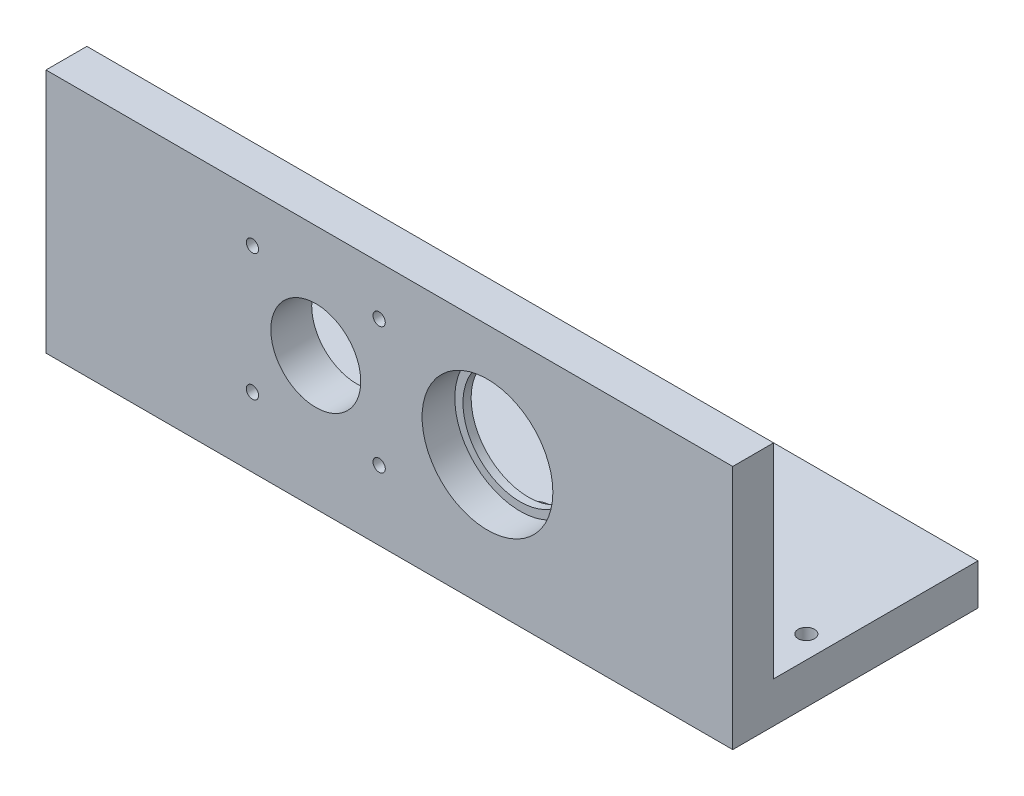
ISO-10303-21;
HEADER;
FILE_DESCRIPTION(('STEP AP214'),'2;1');
FILE_NAME('part.step','',(''),(''),'','','');
FILE_SCHEMA(('AUTOMOTIVE_DESIGN { 1 0 10303 214 1 1 1 1 }'));
ENDSEC;
DATA;
#1=APPLICATION_CONTEXT('core data for automotive mechanical design processes');
#2=APPLICATION_PROTOCOL_DEFINITION('international standard','automotive_design',2000,#1);
#3=PRODUCT_CONTEXT('',#1,'mechanical');
#4=PRODUCT('Part','Part','',(#3));
#5=PRODUCT_RELATED_PRODUCT_CATEGORY('part','',(#4));
#6=PRODUCT_DEFINITION_FORMATION('','',#4);
#7=PRODUCT_DEFINITION_CONTEXT('part definition',#1,'design');
#8=PRODUCT_DEFINITION('design','',#6,#7);
#9=PRODUCT_DEFINITION_SHAPE('','',#8);
#10=(LENGTH_UNIT() NAMED_UNIT(*) SI_UNIT(.MILLI.,.METRE.));
#11=(NAMED_UNIT(*) PLANE_ANGLE_UNIT() SI_UNIT($,.RADIAN.));
#12=(NAMED_UNIT(*) SI_UNIT($,.STERADIAN.) SOLID_ANGLE_UNIT());
#13=UNCERTAINTY_MEASURE_WITH_UNIT(LENGTH_MEASURE(1.E-05),#10,'distance_accuracy_value','');
#14=(GEOMETRIC_REPRESENTATION_CONTEXT(3) GLOBAL_UNCERTAINTY_ASSIGNED_CONTEXT((#13)) GLOBAL_UNIT_ASSIGNED_CONTEXT((#10,
#11,#12)) REPRESENTATION_CONTEXT('',''));
#15=CARTESIAN_POINT('',(0.,0.,0.));
#16=DIRECTION('',(0.,0.,1.));
#17=DIRECTION('',(1.,0.,0.));
#18=AXIS2_PLACEMENT_3D('',#15,#16,#17);
#19=CARTESIAN_POINT('',(108.,32.5,-17.));
#20=DIRECTION('',(0.,0.,1.));
#21=DIRECTION('',(1.,0.,0.));
#22=AXIS2_PLACEMENT_3D('',#19,#20,#21);
#23=CYLINDRICAL_SURFACE('',#22,14.);
#24=CARTESIAN_POINT('',(108.,32.5,0.));
#25=DIRECTION('',(0.,0.,-1.));
#26=DIRECTION('',(-1.,0.,0.));
#27=AXIS2_PLACEMENT_3D('',#24,#25,#26);
#28=CIRCLE('',#27,14.);
#29=CARTESIAN_POINT('',(94.,32.5,0.));
#30=VERTEX_POINT('',#29);
#31=EDGE_CURVE('E275',#30,#30,#28,.T.);
#32=ORIENTED_EDGE('',*,*,#31,.T.);
#33=EDGE_LOOP('',(#32));
#34=FACE_BOUND('',#33,.T.);
#35=CARTESIAN_POINT('',(108.,32.5,2.));
#36=DIRECTION('',(0.,0.,1.));
#37=DIRECTION('',(1.,0.,0.));
#38=AXIS2_PLACEMENT_3D('',#35,#36,#37);
#39=CIRCLE('',#38,14.);
#40=CARTESIAN_POINT('',(122.,32.5,2.));
#41=VERTEX_POINT('',#40);
#42=EDGE_CURVE('E290',#41,#41,#39,.F.);
#43=ORIENTED_EDGE('',*,*,#42,.F.);
#44=EDGE_LOOP('',(#43));
#45=FACE_BOUND('',#44,.T.);
#46=ADVANCED_FACE('F33',(#34,#45),#23,.F.);
#47=CARTESIAN_POINT('',(168.,0.,10.));
#48=DIRECTION('',(0.,1.,0.));
#49=DIRECTION('',(-1.,0.,0.));
#50=AXIS2_PLACEMENT_3D('',#47,#48,#49);
#51=PLANE('',#50);
#52=CARTESIAN_POINT('',(104.,0.,-5.));
#53=DIRECTION('',(0.,1.,0.));
#54=DIRECTION('',(-1.,0.,0.));
#55=AXIS2_PLACEMENT_3D('',#52,#53,#54);
#56=CIRCLE('',#55,2.49999999999999);
#57=CARTESIAN_POINT('',(101.5,0.,-5.));
#58=VERTEX_POINT('',#57);
#59=EDGE_CURVE('E239',#58,#58,#56,.T.);
#60=ORIENTED_EDGE('',*,*,#59,.T.);
#61=EDGE_LOOP('',(#60));
#62=FACE_BOUND('',#61,.T.);
#63=CARTESIAN_POINT('',(64.,0.,-5.));
#64=DIRECTION('',(0.,1.,0.));
#65=DIRECTION('',(-1.,0.,0.));
#66=AXIS2_PLACEMENT_3D('',#63,#64,#65);
#67=CIRCLE('',#66,2.49999999999999);
#68=CARTESIAN_POINT('',(61.5,0.,-5.));
#69=VERTEX_POINT('',#68);
#70=EDGE_CURVE('E233',#69,#69,#67,.T.);
#71=ORIENTED_EDGE('',*,*,#70,.T.);
#72=EDGE_LOOP('',(#71));
#73=FACE_BOUND('',#72,.T.);
#74=CARTESIAN_POINT('',(64.,0.,-20.));
#75=DIRECTION('',(0.,1.,0.));
#76=DIRECTION('',(-1.,0.,0.));
#77=AXIS2_PLACEMENT_3D('',#74,#75,#76);
#78=CIRCLE('',#77,2.5);
#79=CARTESIAN_POINT('',(61.5,0.,-20.));
#80=VERTEX_POINT('',#79);
#81=EDGE_CURVE('E230',#80,#80,#78,.T.);
#82=ORIENTED_EDGE('',*,*,#81,.T.);
#83=EDGE_LOOP('',(#82));
#84=FACE_BOUND('',#83,.T.);
#85=CARTESIAN_POINT('',(104.,0.,-20.));
#86=DIRECTION('',(0.,1.,0.));
#87=DIRECTION('',(-1.,0.,0.));
#88=AXIS2_PLACEMENT_3D('',#85,#86,#87);
#89=CIRCLE('',#88,2.5);
#90=CARTESIAN_POINT('',(101.5,0.,-20.));
#91=VERTEX_POINT('',#90);
#92=EDGE_CURVE('E232',#91,#91,#89,.T.);
#93=ORIENTED_EDGE('',*,*,#92,.T.);
#94=EDGE_LOOP('',(#93));
#95=FACE_BOUND('',#94,.T.);
#96=CARTESIAN_POINT('',(136.5,0.,-13.5));
#97=DIRECTION('',(0.,1.,0.));
#98=DIRECTION('',(-1.,0.,0.));
#99=AXIS2_PLACEMENT_3D('',#96,#97,#98);
#100=CIRCLE('',#99,2.);
#101=CARTESIAN_POINT('',(134.5,0.,-13.5));
#102=VERTEX_POINT('',#101);
#103=EDGE_CURVE('E243',#102,#102,#100,.T.);
#104=ORIENTED_EDGE('',*,*,#103,.T.);
#105=EDGE_LOOP('',(#104));
#106=FACE_BOUND('',#105,.T.);
#107=CARTESIAN_POINT('',(162.5,0.,-13.5));
#108=DIRECTION('',(0.,1.,0.));
#109=DIRECTION('',(-1.,0.,0.));
#110=AXIS2_PLACEMENT_3D('',#107,#108,#109);
#111=CIRCLE('',#110,2.);
#112=CARTESIAN_POINT('',(160.5,0.,-13.5));
#113=VERTEX_POINT('',#112);
#114=EDGE_CURVE('E249',#113,#113,#111,.T.);
#115=ORIENTED_EDGE('',*,*,#114,.T.);
#116=EDGE_LOOP('',(#115));
#117=FACE_BOUND('',#116,.T.);
#118=CARTESIAN_POINT('',(31.5,0.,-13.5));
#119=DIRECTION('',(0.,1.,0.));
#120=DIRECTION('',(-1.,0.,0.));
#121=AXIS2_PLACEMENT_3D('',#118,#119,#120);
#122=CIRCLE('',#121,2.);
#123=CARTESIAN_POINT('',(29.5,0.,-13.5));
#124=VERTEX_POINT('',#123);
#125=EDGE_CURVE('E255',#124,#124,#122,.T.);
#126=ORIENTED_EDGE('',*,*,#125,.T.);
#127=EDGE_LOOP('',(#126));
#128=FACE_BOUND('',#127,.T.);
#129=CARTESIAN_POINT('',(5.5,0.,-13.5));
#130=DIRECTION('',(0.,1.,0.));
#131=DIRECTION('',(-1.,0.,0.));
#132=AXIS2_PLACEMENT_3D('',#129,#130,#131);
#133=CIRCLE('',#132,2.);
#134=CARTESIAN_POINT('',(3.49999999999999,0.,-13.5));
#135=VERTEX_POINT('',#134);
#136=EDGE_CURVE('E120',#135,#135,#133,.T.);
#137=ORIENTED_EDGE('',*,*,#136,.T.);
#138=EDGE_LOOP('',(#137));
#139=FACE_BOUND('',#138,.T.);
#140=DIRECTION('',(0.,0.,-1.));
#141=VECTOR('',#140,1.);
#142=CARTESIAN_POINT('',(0.,0.,10.));
#143=LINE('',#142,#141);
#144=CARTESIAN_POINT('',(0.,0.,10.));
#145=VERTEX_POINT('',#144);
#146=CARTESIAN_POINT('',(0.,0.,-50.));
#147=VERTEX_POINT('',#146);
#148=EDGE_CURVE('E110',#145,#147,#143,.T.);
#149=ORIENTED_EDGE('',*,*,#148,.T.);
#150=DIRECTION('',(-1.,0.,0.));
#151=VECTOR('',#150,1.);
#152=CARTESIAN_POINT('',(168.,0.,-50.));
#153=LINE('',#152,#151);
#154=CARTESIAN_POINT('',(168.,0.,-50.));
#155=VERTEX_POINT('',#154);
#156=EDGE_CURVE('E108',#155,#147,#153,.T.);
#157=ORIENTED_EDGE('',*,*,#156,.F.);
#158=DIRECTION('',(0.,0.,-1.));
#159=VECTOR('',#158,1.);
#160=CARTESIAN_POINT('',(168.,0.,10.));
#161=LINE('',#160,#159);
#162=CARTESIAN_POINT('',(168.,0.,10.));
#163=VERTEX_POINT('',#162);
#164=EDGE_CURVE('E96',#163,#155,#161,.T.);
#165=ORIENTED_EDGE('',*,*,#164,.F.);
#166=DIRECTION('',(1.,0.,0.));
#167=VECTOR('',#166,1.);
#168=CARTESIAN_POINT('',(168.,0.,10.));
#169=LINE('',#168,#167);
#170=EDGE_CURVE('E282',#145,#163,#169,.T.);
#171=ORIENTED_EDGE('',*,*,#170,.F.);
#172=EDGE_LOOP('',(#149,#157,#165,#171));
#173=FACE_BOUND('',#172,.T.);
#174=ADVANCED_FACE('F109',(#62,#73,#84,#95,#106,#117,#128,#139,#173),#51,.F.);
#175=CARTESIAN_POINT('',(168.,60.,10.));
#176=DIRECTION('',(-1.,0.,0.));
#177=DIRECTION('',(0.,0.,1.));
#178=AXIS2_PLACEMENT_3D('',#175,#176,#177);
#179=PLANE('',#178);
#180=ORIENTED_EDGE('',*,*,#164,.T.);
#181=DIRECTION('',(0.,-1.,0.));
#182=VECTOR('',#181,1.);
#183=CARTESIAN_POINT('',(168.,10.,-50.));
#184=LINE('',#183,#182);
#185=CARTESIAN_POINT('',(168.,10.,-50.));
#186=VERTEX_POINT('',#185);
#187=EDGE_CURVE('E101',#186,#155,#184,.T.);
#188=ORIENTED_EDGE('',*,*,#187,.F.);
#189=DIRECTION('',(0.,0.,1.));
#190=VECTOR('',#189,1.);
#191=CARTESIAN_POINT('',(168.,10.,-50.));
#192=LINE('',#191,#190);
#193=CARTESIAN_POINT('',(168.,10.,0.));
#194=VERTEX_POINT('',#193);
#195=EDGE_CURVE('E128',#186,#194,#192,.T.);
#196=ORIENTED_EDGE('',*,*,#195,.T.);
#197=DIRECTION('',(0.,1.,0.));
#198=VECTOR('',#197,1.);
#199=CARTESIAN_POINT('',(168.,60.,0.));
#200=LINE('',#199,#198);
#201=CARTESIAN_POINT('',(168.,60.,0.));
#202=VERTEX_POINT('',#201);
#203=EDGE_CURVE('E135',#194,#202,#200,.T.);
#204=ORIENTED_EDGE('',*,*,#203,.T.);
#205=DIRECTION('',(0.,0.,-1.));
#206=VECTOR('',#205,1.);
#207=CARTESIAN_POINT('',(168.,60.,10.));
#208=LINE('',#207,#206);
#209=CARTESIAN_POINT('',(168.,60.,10.));
#210=VERTEX_POINT('',#209);
#211=EDGE_CURVE('E105',#210,#202,#208,.T.);
#212=ORIENTED_EDGE('',*,*,#211,.F.);
#213=DIRECTION('',(0.,1.,0.));
#214=VECTOR('',#213,1.);
#215=CARTESIAN_POINT('',(168.,60.,10.));
#216=LINE('',#215,#214);
#217=EDGE_CURVE('E81',#163,#210,#216,.T.);
#218=ORIENTED_EDGE('',*,*,#217,.F.);
#219=EDGE_LOOP('',(#180,#188,#196,#204,#212,#218));
#220=FACE_BOUND('',#219,.T.);
#221=ADVANCED_FACE('F98',(#220),#179,.F.);
#222=CARTESIAN_POINT('',(0.,60.,10.));
#223=DIRECTION('',(0.,-1.,0.));
#224=DIRECTION('',(0.,0.,-1.));
#225=AXIS2_PLACEMENT_3D('',#222,#223,#224);
#226=PLANE('',#225);
#227=DIRECTION('',(-1.,0.,0.));
#228=VECTOR('',#227,1.);
#229=CARTESIAN_POINT('',(0.,60.,0.));
#230=LINE('',#229,#228);
#231=CARTESIAN_POINT('',(0.,60.,0.));
#232=VERTEX_POINT('',#231);
#233=EDGE_CURVE('E73',#202,#232,#230,.T.);
#234=ORIENTED_EDGE('',*,*,#233,.T.);
#235=DIRECTION('',(0.,0.,-1.));
#236=VECTOR('',#235,1.);
#237=CARTESIAN_POINT('',(0.,60.,10.));
#238=LINE('',#237,#236);
#239=CARTESIAN_POINT('',(0.,60.,10.));
#240=VERTEX_POINT('',#239);
#241=EDGE_CURVE('E277',#240,#232,#238,.T.);
#242=ORIENTED_EDGE('',*,*,#241,.F.);
#243=DIRECTION('',(-1.,0.,0.));
#244=VECTOR('',#243,1.);
#245=CARTESIAN_POINT('',(0.,60.,10.));
#246=LINE('',#245,#244);
#247=EDGE_CURVE('E276',#210,#240,#246,.T.);
#248=ORIENTED_EDGE('',*,*,#247,.F.);
#249=ORIENTED_EDGE('',*,*,#211,.T.);
#250=EDGE_LOOP('',(#234,#242,#248,#249));
#251=FACE_BOUND('',#250,.T.);
#252=ADVANCED_FACE('F203',(#251),#226,.F.);
#253=CARTESIAN_POINT('',(0.,0.,10.));
#254=DIRECTION('',(1.,0.,0.));
#255=DIRECTION('',(0.,0.,-1.));
#256=AXIS2_PLACEMENT_3D('',#253,#254,#255);
#257=PLANE('',#256);
#258=DIRECTION('',(0.,-1.,0.));
#259=VECTOR('',#258,1.);
#260=CARTESIAN_POINT('',(0.,0.,0.));
#261=LINE('',#260,#259);
#262=CARTESIAN_POINT('',(0.,10.,0.));
#263=VERTEX_POINT('',#262);
#264=EDGE_CURVE('E280',#232,#263,#261,.T.);
#265=ORIENTED_EDGE('',*,*,#264,.T.);
#266=DIRECTION('',(0.,0.,1.));
#267=VECTOR('',#266,1.);
#268=CARTESIAN_POINT('',(0.,10.,-50.));
#269=LINE('',#268,#267);
#270=CARTESIAN_POINT('',(0.,10.,-50.));
#271=VERTEX_POINT('',#270);
#272=EDGE_CURVE('E139',#271,#263,#269,.T.);
#273=ORIENTED_EDGE('',*,*,#272,.F.);
#274=DIRECTION('',(0.,1.,0.));
#275=VECTOR('',#274,1.);
#276=CARTESIAN_POINT('',(0.,0.,-50.));
#277=LINE('',#276,#275);
#278=EDGE_CURVE('E113',#147,#271,#277,.T.);
#279=ORIENTED_EDGE('',*,*,#278,.F.);
#280=ORIENTED_EDGE('',*,*,#148,.F.);
#281=DIRECTION('',(0.,-1.,0.));
#282=VECTOR('',#281,1.);
#283=CARTESIAN_POINT('',(0.,0.,10.));
#284=LINE('',#283,#282);
#285=EDGE_CURVE('E57',#240,#145,#284,.T.);
#286=ORIENTED_EDGE('',*,*,#285,.F.);
#287=ORIENTED_EDGE('',*,*,#241,.T.);
#288=EDGE_LOOP('',(#265,#273,#279,#280,#286,#287));
#289=FACE_BOUND('',#288,.T.);
#290=ADVANCED_FACE('F195',(#289),#257,.F.);
#291=CARTESIAN_POINT('',(0.,0.,10.));
#292=DIRECTION('',(0.,0.,-1.));
#293=DIRECTION('',(-1.,0.,0.));
#294=AXIS2_PLACEMENT_3D('',#291,#292,#293);
#295=PLANE('',#294);
#296=CARTESIAN_POINT('',(81.5,48.,10.));
#297=DIRECTION('',(0.,0.,-1.));
#298=DIRECTION('',(-1.,0.,0.));
#299=AXIS2_PLACEMENT_3D('',#296,#297,#298);
#300=CIRCLE('',#299,1.5);
#301=CARTESIAN_POINT('',(80.,48.,10.));
#302=VERTEX_POINT('',#301);
#303=EDGE_CURVE('E549',#302,#302,#300,.T.);
#304=ORIENTED_EDGE('',*,*,#303,.T.);
#305=EDGE_LOOP('',(#304));
#306=FACE_BOUND('',#305,.T.);
#307=CARTESIAN_POINT('',(81.5,17.,10.));
#308=DIRECTION('',(0.,0.,-1.));
#309=DIRECTION('',(-1.,0.,0.));
#310=AXIS2_PLACEMENT_3D('',#307,#308,#309);
#311=CIRCLE('',#310,1.5);
#312=CARTESIAN_POINT('',(80.,17.,10.));
#313=VERTEX_POINT('',#312);
#314=EDGE_CURVE('E553',#313,#313,#311,.T.);
#315=ORIENTED_EDGE('',*,*,#314,.T.);
#316=EDGE_LOOP('',(#315));
#317=FACE_BOUND('',#316,.T.);
#318=CARTESIAN_POINT('',(50.5,17.,10.));
#319=DIRECTION('',(0.,0.,-1.));
#320=DIRECTION('',(-1.,0.,0.));
#321=AXIS2_PLACEMENT_3D('',#318,#319,#320);
#322=CIRCLE('',#321,1.5);
#323=CARTESIAN_POINT('',(49.,17.,10.));
#324=VERTEX_POINT('',#323);
#325=EDGE_CURVE('E562',#324,#324,#322,.T.);
#326=ORIENTED_EDGE('',*,*,#325,.T.);
#327=EDGE_LOOP('',(#326));
#328=FACE_BOUND('',#327,.T.);
#329=CARTESIAN_POINT('',(50.5,48.,10.));
#330=DIRECTION('',(0.,0.,-1.));
#331=DIRECTION('',(-1.,0.,0.));
#332=AXIS2_PLACEMENT_3D('',#329,#330,#331);
#333=CIRCLE('',#332,1.5);
#334=CARTESIAN_POINT('',(49.,48.,10.));
#335=VERTEX_POINT('',#334);
#336=EDGE_CURVE('E568',#335,#335,#333,.T.);
#337=ORIENTED_EDGE('',*,*,#336,.T.);
#338=EDGE_LOOP('',(#337));
#339=FACE_BOUND('',#338,.T.);
#340=CARTESIAN_POINT('',(66.,32.50089026,10.));
#341=DIRECTION('',(0.,0.,-1.));
#342=DIRECTION('',(-1.,0.,0.));
#343=AXIS2_PLACEMENT_3D('',#340,#341,#342);
#344=CIRCLE('',#343,11.);
#345=CARTESIAN_POINT('',(55.,32.50089026,10.));
#346=VERTEX_POINT('',#345);
#347=EDGE_CURVE('E301',#346,#346,#344,.T.);
#348=ORIENTED_EDGE('',*,*,#347,.T.);
#349=EDGE_LOOP('',(#348));
#350=FACE_BOUND('',#349,.T.);
#351=CARTESIAN_POINT('',(108.,32.5,10.));
#352=DIRECTION('',(0.,0.,1.));
#353=DIRECTION('',(1.,0.,0.));
#354=AXIS2_PLACEMENT_3D('',#351,#352,#353);
#355=CIRCLE('',#354,16.);
#356=CARTESIAN_POINT('',(124.,32.5,10.));
#357=VERTEX_POINT('',#356);
#358=EDGE_CURVE('E298',#357,#357,#355,.T.);
#359=ORIENTED_EDGE('',*,*,#358,.F.);
#360=EDGE_LOOP('',(#359));
#361=FACE_BOUND('',#360,.T.);
#362=ORIENTED_EDGE('',*,*,#170,.T.);
#363=ORIENTED_EDGE('',*,*,#217,.T.);
#364=ORIENTED_EDGE('',*,*,#247,.T.);
#365=ORIENTED_EDGE('',*,*,#285,.T.);
#366=EDGE_LOOP('',(#362,#363,#364,#365));
#367=FACE_BOUND('',#366,.T.);
#368=ADVANCED_FACE('F191',(#306,#317,#328,#339,#350,#361,#367),#295,.F.);
#369=CARTESIAN_POINT('',(0.,0.,0.));
#370=DIRECTION('',(0.,0.,-1.));
#371=DIRECTION('',(-1.,0.,0.));
#372=AXIS2_PLACEMENT_3D('',#369,#370,#371);
#373=PLANE('',#372);
#374=CARTESIAN_POINT('',(81.5,48.,0.));
#375=DIRECTION('',(0.,0.,-1.));
#376=DIRECTION('',(-1.,0.,0.));
#377=AXIS2_PLACEMENT_3D('',#374,#375,#376);
#378=CIRCLE('',#377,1.5);
#379=CARTESIAN_POINT('',(80.,48.,0.));
#380=VERTEX_POINT('',#379);
#381=EDGE_CURVE('E546',#380,#380,#378,.T.);
#382=ORIENTED_EDGE('',*,*,#381,.F.);
#383=EDGE_LOOP('',(#382));
#384=FACE_BOUND('',#383,.T.);
#385=CARTESIAN_POINT('',(81.5,17.,0.));
#386=DIRECTION('',(0.,0.,-1.));
#387=DIRECTION('',(-1.,0.,0.));
#388=AXIS2_PLACEMENT_3D('',#385,#386,#387);
#389=CIRCLE('',#388,1.5);
#390=CARTESIAN_POINT('',(80.,17.,0.));
#391=VERTEX_POINT('',#390);
#392=EDGE_CURVE('E550',#391,#391,#389,.T.);
#393=ORIENTED_EDGE('',*,*,#392,.F.);
#394=EDGE_LOOP('',(#393));
#395=FACE_BOUND('',#394,.T.);
#396=CARTESIAN_POINT('',(50.5,17.,0.));
#397=DIRECTION('',(0.,0.,-1.));
#398=DIRECTION('',(-1.,0.,0.));
#399=AXIS2_PLACEMENT_3D('',#396,#397,#398);
#400=CIRCLE('',#399,1.5);
#401=CARTESIAN_POINT('',(49.,17.,0.));
#402=VERTEX_POINT('',#401);
#403=EDGE_CURVE('E559',#402,#402,#400,.T.);
#404=ORIENTED_EDGE('',*,*,#403,.F.);
#405=EDGE_LOOP('',(#404));
#406=FACE_BOUND('',#405,.T.);
#407=CARTESIAN_POINT('',(50.5,48.,0.));
#408=DIRECTION('',(0.,0.,-1.));
#409=DIRECTION('',(-1.,0.,0.));
#410=AXIS2_PLACEMENT_3D('',#407,#408,#409);
#411=CIRCLE('',#410,1.5);
#412=CARTESIAN_POINT('',(49.,48.,0.));
#413=VERTEX_POINT('',#412);
#414=EDGE_CURVE('E565',#413,#413,#411,.T.);
#415=ORIENTED_EDGE('',*,*,#414,.F.);
#416=EDGE_LOOP('',(#415));
#417=FACE_BOUND('',#416,.T.);
#418=DIRECTION('',(1.,0.,0.));
#419=VECTOR('',#418,1.);
#420=CARTESIAN_POINT('',(0.,10.,0.));
#421=LINE('',#420,#419);
#422=EDGE_CURVE('E48',#263,#194,#421,.T.);
#423=ORIENTED_EDGE('',*,*,#422,.F.);
#424=ORIENTED_EDGE('',*,*,#264,.F.);
#425=ORIENTED_EDGE('',*,*,#233,.F.);
#426=ORIENTED_EDGE('',*,*,#203,.F.);
#427=EDGE_LOOP('',(#423,#424,#425,#426));
#428=FACE_BOUND('',#427,.T.);
#429=CARTESIAN_POINT('',(66.,32.50089026,0.));
#430=DIRECTION('',(0.,0.,-1.));
#431=DIRECTION('',(-1.,0.,0.));
#432=AXIS2_PLACEMENT_3D('',#429,#430,#431);
#433=CIRCLE('',#432,11.);
#434=CARTESIAN_POINT('',(55.,32.50089026,0.));
#435=VERTEX_POINT('',#434);
#436=EDGE_CURVE('E131',#435,#435,#433,.T.);
#437=ORIENTED_EDGE('',*,*,#436,.F.);
#438=EDGE_LOOP('',(#437));
#439=FACE_BOUND('',#438,.T.);
#440=ORIENTED_EDGE('',*,*,#31,.F.);
#441=EDGE_LOOP('',(#440));
#442=FACE_BOUND('',#441,.T.);
#443=ADVANCED_FACE('F194',(#384,#395,#406,#417,#428,#439,#442),#373,.T.);
#444=CARTESIAN_POINT('',(108.,32.5,2.));
#445=DIRECTION('',(0.,0.,1.));
#446=DIRECTION('',(1.,0.,0.));
#447=AXIS2_PLACEMENT_3D('',#444,#445,#446);
#448=PLANE('',#447);
#449=CARTESIAN_POINT('',(108.,32.5,2.));
#450=DIRECTION('',(0.,0.,1.));
#451=DIRECTION('',(1.,0.,0.));
#452=AXIS2_PLACEMENT_3D('',#449,#450,#451);
#453=CIRCLE('',#452,16.);
#454=CARTESIAN_POINT('',(124.,32.5,2.));
#455=VERTEX_POINT('',#454);
#456=EDGE_CURVE('E293',#455,#455,#453,.T.);
#457=ORIENTED_EDGE('',*,*,#456,.T.);
#458=EDGE_LOOP('',(#457));
#459=FACE_BOUND('',#458,.T.);
#460=ORIENTED_EDGE('',*,*,#42,.T.);
#461=EDGE_LOOP('',(#460));
#462=FACE_BOUND('',#461,.T.);
#463=ADVANCED_FACE('F199',(#459,#462),#448,.T.);
#464=CARTESIAN_POINT('',(108.,32.5,2.));
#465=DIRECTION('',(0.,0.,1.));
#466=DIRECTION('',(1.,0.,0.));
#467=AXIS2_PLACEMENT_3D('',#464,#465,#466);
#468=CYLINDRICAL_SURFACE('',#467,16.);
#469=ORIENTED_EDGE('',*,*,#456,.F.);
#470=EDGE_LOOP('',(#469));
#471=FACE_BOUND('',#470,.T.);
#472=ORIENTED_EDGE('',*,*,#358,.T.);
#473=EDGE_LOOP('',(#472));
#474=FACE_BOUND('',#473,.T.);
#475=ADVANCED_FACE('F189',(#471,#474),#468,.F.);
#476=CARTESIAN_POINT('',(66.,32.50089026,21.6));
#477=DIRECTION('',(0.,0.,-1.));
#478=DIRECTION('',(-1.,0.,0.));
#479=AXIS2_PLACEMENT_3D('',#476,#477,#478);
#480=CYLINDRICAL_SURFACE('',#479,11.);
#481=ORIENTED_EDGE('',*,*,#436,.T.);
#482=EDGE_LOOP('',(#481));
#483=FACE_BOUND('',#482,.T.);
#484=ORIENTED_EDGE('',*,*,#347,.F.);
#485=EDGE_LOOP('',(#484));
#486=FACE_BOUND('',#485,.T.);
#487=ADVANCED_FACE('F270',(#483,#486),#480,.F.);
#488=CARTESIAN_POINT('',(0.,10.,-50.));
#489=DIRECTION('',(0.,-1.,0.));
#490=DIRECTION('',(1.,0.,0.));
#491=AXIS2_PLACEMENT_3D('',#488,#489,#490);
#492=PLANE('',#491);
#493=CARTESIAN_POINT('',(104.,10.,-5.));
#494=DIRECTION('',(0.,-1.,0.));
#495=DIRECTION('',(1.,0.,0.));
#496=AXIS2_PLACEMENT_3D('',#493,#494,#495);
#497=CIRCLE('',#496,4.5);
#498=CARTESIAN_POINT('',(108.5,10.,-5.));
#499=VERTEX_POINT('',#498);
#500=EDGE_CURVE('E11',#499,#499,#497,.T.);
#501=ORIENTED_EDGE('',*,*,#500,.T.);
#502=EDGE_LOOP('',(#501));
#503=FACE_BOUND('',#502,.T.);
#504=CARTESIAN_POINT('',(104.,10.,-20.));
#505=DIRECTION('',(0.,-1.,0.));
#506=DIRECTION('',(1.,0.,0.));
#507=AXIS2_PLACEMENT_3D('',#504,#505,#506);
#508=CIRCLE('',#507,4.5);
#509=CARTESIAN_POINT('',(108.5,10.,-20.));
#510=VERTEX_POINT('',#509);
#511=EDGE_CURVE('E160',#510,#510,#508,.T.);
#512=ORIENTED_EDGE('',*,*,#511,.T.);
#513=EDGE_LOOP('',(#512));
#514=FACE_BOUND('',#513,.T.);
#515=CARTESIAN_POINT('',(64.,10.,-20.));
#516=DIRECTION('',(0.,-1.,0.));
#517=DIRECTION('',(1.,0.,0.));
#518=AXIS2_PLACEMENT_3D('',#515,#516,#517);
#519=CIRCLE('',#518,4.5);
#520=CARTESIAN_POINT('',(68.5,10.,-20.));
#521=VERTEX_POINT('',#520);
#522=EDGE_CURVE('E154',#521,#521,#519,.T.);
#523=ORIENTED_EDGE('',*,*,#522,.T.);
#524=EDGE_LOOP('',(#523));
#525=FACE_BOUND('',#524,.T.);
#526=CARTESIAN_POINT('',(64.,10.,-5.));
#527=DIRECTION('',(0.,-1.,0.));
#528=DIRECTION('',(1.,0.,0.));
#529=AXIS2_PLACEMENT_3D('',#526,#527,#528);
#530=CIRCLE('',#529,4.5);
#531=CARTESIAN_POINT('',(68.5,10.,-5.));
#532=VERTEX_POINT('',#531);
#533=EDGE_CURVE('E148',#532,#532,#530,.T.);
#534=ORIENTED_EDGE('',*,*,#533,.T.);
#535=EDGE_LOOP('',(#534));
#536=FACE_BOUND('',#535,.T.);
#537=CARTESIAN_POINT('',(136.5,10.,-13.5));
#538=DIRECTION('',(0.,1.,0.));
#539=DIRECTION('',(-1.,0.,0.));
#540=AXIS2_PLACEMENT_3D('',#537,#538,#539);
#541=CIRCLE('',#540,2.);
#542=CARTESIAN_POINT('',(134.5,10.,-13.5));
#543=VERTEX_POINT('',#542);
#544=EDGE_CURVE('E236',#543,#543,#541,.T.);
#545=ORIENTED_EDGE('',*,*,#544,.F.);
#546=EDGE_LOOP('',(#545));
#547=FACE_BOUND('',#546,.T.);
#548=CARTESIAN_POINT('',(162.5,10.,-13.5));
#549=DIRECTION('',(0.,1.,0.));
#550=DIRECTION('',(-1.,0.,0.));
#551=AXIS2_PLACEMENT_3D('',#548,#549,#550);
#552=CIRCLE('',#551,2.);
#553=CARTESIAN_POINT('',(160.5,10.,-13.5));
#554=VERTEX_POINT('',#553);
#555=EDGE_CURVE('E246',#554,#554,#552,.T.);
#556=ORIENTED_EDGE('',*,*,#555,.F.);
#557=EDGE_LOOP('',(#556));
#558=FACE_BOUND('',#557,.T.);
#559=CARTESIAN_POINT('',(31.5,10.,-13.5));
#560=DIRECTION('',(0.,1.,0.));
#561=DIRECTION('',(-1.,0.,0.));
#562=AXIS2_PLACEMENT_3D('',#559,#560,#561);
#563=CIRCLE('',#562,2.);
#564=CARTESIAN_POINT('',(29.5,10.,-13.5));
#565=VERTEX_POINT('',#564);
#566=EDGE_CURVE('E252',#565,#565,#563,.T.);
#567=ORIENTED_EDGE('',*,*,#566,.F.);
#568=EDGE_LOOP('',(#567));
#569=FACE_BOUND('',#568,.T.);
#570=CARTESIAN_POINT('',(5.5,10.,-13.5));
#571=DIRECTION('',(0.,1.,0.));
#572=DIRECTION('',(-1.,0.,0.));
#573=AXIS2_PLACEMENT_3D('',#570,#571,#572);
#574=CIRCLE('',#573,2.);
#575=CARTESIAN_POINT('',(3.5,10.,-13.5));
#576=VERTEX_POINT('',#575);
#577=EDGE_CURVE('E123',#576,#576,#574,.T.);
#578=ORIENTED_EDGE('',*,*,#577,.F.);
#579=EDGE_LOOP('',(#578));
#580=FACE_BOUND('',#579,.T.);
#581=ORIENTED_EDGE('',*,*,#422,.T.);
#582=ORIENTED_EDGE('',*,*,#195,.F.);
#583=DIRECTION('',(1.,0.,0.));
#584=VECTOR('',#583,1.);
#585=CARTESIAN_POINT('',(0.,10.,-50.));
#586=LINE('',#585,#584);
#587=EDGE_CURVE('E117',#271,#186,#586,.T.);
#588=ORIENTED_EDGE('',*,*,#587,.F.);
#589=ORIENTED_EDGE('',*,*,#272,.T.);
#590=EDGE_LOOP('',(#581,#582,#588,#589));
#591=FACE_BOUND('',#590,.T.);
#592=ADVANCED_FACE('F267',(#503,#514,#525,#536,#547,#558,#569,#580,#591),#492,.F.);
#593=CARTESIAN_POINT('',(0.,0.,-50.));
#594=DIRECTION('',(0.,0.,-1.));
#595=DIRECTION('',(-1.,0.,0.));
#596=AXIS2_PLACEMENT_3D('',#593,#594,#595);
#597=PLANE('',#596);
#598=ORIENTED_EDGE('',*,*,#187,.T.);
#599=ORIENTED_EDGE('',*,*,#156,.T.);
#600=ORIENTED_EDGE('',*,*,#278,.T.);
#601=ORIENTED_EDGE('',*,*,#587,.T.);
#602=EDGE_LOOP('',(#598,#599,#600,#601));
#603=FACE_BOUND('',#602,.T.);
#604=ADVANCED_FACE('F115',(#603),#597,.T.);
#605=CARTESIAN_POINT('',(5.5,0.,-13.5));
#606=DIRECTION('',(0.,1.,0.));
#607=DIRECTION('',(-1.,0.,0.));
#608=AXIS2_PLACEMENT_3D('',#605,#606,#607);
#609=CYLINDRICAL_SURFACE('',#608,2.);
#610=ORIENTED_EDGE('',*,*,#136,.F.);
#611=EDGE_LOOP('',(#610));
#612=FACE_BOUND('',#611,.T.);
#613=ORIENTED_EDGE('',*,*,#577,.T.);
#614=EDGE_LOOP('',(#613));
#615=FACE_BOUND('',#614,.T.);
#616=ADVANCED_FACE('F265',(#612,#615),#609,.F.);
#617=CARTESIAN_POINT('',(31.5,0.,-13.5));
#618=DIRECTION('',(0.,1.,0.));
#619=DIRECTION('',(-1.,0.,0.));
#620=AXIS2_PLACEMENT_3D('',#617,#618,#619);
#621=CYLINDRICAL_SURFACE('',#620,2.);
#622=ORIENTED_EDGE('',*,*,#125,.F.);
#623=EDGE_LOOP('',(#622));
#624=FACE_BOUND('',#623,.T.);
#625=ORIENTED_EDGE('',*,*,#566,.T.);
#626=EDGE_LOOP('',(#625));
#627=FACE_BOUND('',#626,.T.);
#628=ADVANCED_FACE('F372',(#624,#627),#621,.F.);
#629=CARTESIAN_POINT('',(162.5,0.,-13.5));
#630=DIRECTION('',(0.,1.,0.));
#631=DIRECTION('',(-1.,0.,0.));
#632=AXIS2_PLACEMENT_3D('',#629,#630,#631);
#633=CYLINDRICAL_SURFACE('',#632,2.);
#634=ORIENTED_EDGE('',*,*,#114,.F.);
#635=EDGE_LOOP('',(#634));
#636=FACE_BOUND('',#635,.T.);
#637=ORIENTED_EDGE('',*,*,#555,.T.);
#638=EDGE_LOOP('',(#637));
#639=FACE_BOUND('',#638,.T.);
#640=ADVANCED_FACE('F382',(#636,#639),#633,.F.);
#641=CARTESIAN_POINT('',(136.5,0.,-13.5));
#642=DIRECTION('',(0.,1.,0.));
#643=DIRECTION('',(-1.,0.,0.));
#644=AXIS2_PLACEMENT_3D('',#641,#642,#643);
#645=CYLINDRICAL_SURFACE('',#644,2.);
#646=ORIENTED_EDGE('',*,*,#103,.F.);
#647=EDGE_LOOP('',(#646));
#648=FACE_BOUND('',#647,.T.);
#649=ORIENTED_EDGE('',*,*,#544,.T.);
#650=EDGE_LOOP('',(#649));
#651=FACE_BOUND('',#650,.T.);
#652=ADVANCED_FACE('F392',(#648,#651),#645,.F.);
#653=CARTESIAN_POINT('',(104.,0.,-20.));
#654=DIRECTION('',(0.,1.,0.));
#655=DIRECTION('',(-1.,0.,0.));
#656=AXIS2_PLACEMENT_3D('',#653,#654,#655);
#657=CYLINDRICAL_SURFACE('',#656,2.5);
#658=CARTESIAN_POINT('',(104.,8.,-20.));
#659=DIRECTION('',(0.,-1.,0.));
#660=DIRECTION('',(0.,0.,-1.));
#661=AXIS2_PLACEMENT_3D('',#658,#659,#660);
#662=CIRCLE('',#661,2.5);
#663=CARTESIAN_POINT('',(104.,8.,-22.5));
#664=VERTEX_POINT('',#663);
#665=EDGE_CURVE('E157',#664,#664,#662,.F.);
#666=ORIENTED_EDGE('',*,*,#665,.T.);
#667=EDGE_LOOP('',(#666));
#668=FACE_BOUND('',#667,.T.);
#669=ORIENTED_EDGE('',*,*,#92,.F.);
#670=EDGE_LOOP('',(#669));
#671=FACE_BOUND('',#670,.T.);
#672=ADVANCED_FACE('F226',(#668,#671),#657,.F.);
#673=CARTESIAN_POINT('',(64.,0.,-20.));
#674=DIRECTION('',(0.,1.,0.));
#675=DIRECTION('',(-1.,0.,0.));
#676=AXIS2_PLACEMENT_3D('',#673,#674,#675);
#677=CYLINDRICAL_SURFACE('',#676,2.5);
#678=CARTESIAN_POINT('',(64.,8.00000000000001,-20.));
#679=DIRECTION('',(0.,-1.,0.));
#680=DIRECTION('',(0.,0.,-1.));
#681=AXIS2_PLACEMENT_3D('',#678,#679,#680);
#682=CIRCLE('',#681,2.5);
#683=CARTESIAN_POINT('',(64.,8.00000000000001,-22.5));
#684=VERTEX_POINT('',#683);
#685=EDGE_CURVE('E151',#684,#684,#682,.F.);
#686=ORIENTED_EDGE('',*,*,#685,.T.);
#687=EDGE_LOOP('',(#686));
#688=FACE_BOUND('',#687,.T.);
#689=ORIENTED_EDGE('',*,*,#81,.F.);
#690=EDGE_LOOP('',(#689));
#691=FACE_BOUND('',#690,.T.);
#692=ADVANCED_FACE('F222',(#688,#691),#677,.F.);
#693=CARTESIAN_POINT('',(64.,0.,-5.));
#694=DIRECTION('',(0.,1.,0.));
#695=DIRECTION('',(-1.,0.,0.));
#696=AXIS2_PLACEMENT_3D('',#693,#694,#695);
#697=CYLINDRICAL_SURFACE('',#696,2.49999999999999);
#698=CARTESIAN_POINT('',(64.,8.00000000000001,-5.));
#699=DIRECTION('',(0.,-1.,0.));
#700=DIRECTION('',(0.,0.,-1.));
#701=AXIS2_PLACEMENT_3D('',#698,#699,#700);
#702=CIRCLE('',#701,2.49999999999999);
#703=CARTESIAN_POINT('',(64.,8.00000000000001,-7.5));
#704=VERTEX_POINT('',#703);
#705=EDGE_CURVE('E104',#704,#704,#702,.F.);
#706=ORIENTED_EDGE('',*,*,#705,.T.);
#707=EDGE_LOOP('',(#706));
#708=FACE_BOUND('',#707,.T.);
#709=ORIENTED_EDGE('',*,*,#70,.F.);
#710=EDGE_LOOP('',(#709));
#711=FACE_BOUND('',#710,.T.);
#712=ADVANCED_FACE('F225',(#708,#711),#697,.F.);
#713=CARTESIAN_POINT('',(104.,0.,-5.));
#714=DIRECTION('',(0.,1.,0.));
#715=DIRECTION('',(-1.,0.,0.));
#716=AXIS2_PLACEMENT_3D('',#713,#714,#715);
#717=CYLINDRICAL_SURFACE('',#716,2.49999999999999);
#718=CARTESIAN_POINT('',(104.,8.,-5.));
#719=DIRECTION('',(0.,-1.,0.));
#720=DIRECTION('',(0.,0.,-1.));
#721=AXIS2_PLACEMENT_3D('',#718,#719,#720);
#722=CIRCLE('',#721,2.49999999999999);
#723=CARTESIAN_POINT('',(104.,8.,-7.5));
#724=VERTEX_POINT('',#723);
#725=EDGE_CURVE('E41',#724,#724,#722,.F.);
#726=ORIENTED_EDGE('',*,*,#725,.T.);
#727=EDGE_LOOP('',(#726));
#728=FACE_BOUND('',#727,.T.);
#729=ORIENTED_EDGE('',*,*,#59,.F.);
#730=EDGE_LOOP('',(#729));
#731=FACE_BOUND('',#730,.T.);
#732=ADVANCED_FACE('F165',(#728,#731),#717,.F.);
#733=CARTESIAN_POINT('',(50.5,48.,27.));
#734=DIRECTION('',(0.,0.,-1.));
#735=DIRECTION('',(-1.,0.,0.));
#736=AXIS2_PLACEMENT_3D('',#733,#734,#735);
#737=CYLINDRICAL_SURFACE('',#736,1.5);
#738=ORIENTED_EDGE('',*,*,#414,.T.);
#739=EDGE_LOOP('',(#738));
#740=FACE_BOUND('',#739,.T.);
#741=ORIENTED_EDGE('',*,*,#336,.F.);
#742=EDGE_LOOP('',(#741));
#743=FACE_BOUND('',#742,.T.);
#744=ADVANCED_FACE('F426',(#740,#743),#737,.F.);
#745=CARTESIAN_POINT('',(50.5,17.,27.));
#746=DIRECTION('',(0.,0.,-1.));
#747=DIRECTION('',(-1.,0.,0.));
#748=AXIS2_PLACEMENT_3D('',#745,#746,#747);
#749=CYLINDRICAL_SURFACE('',#748,1.5);
#750=ORIENTED_EDGE('',*,*,#403,.T.);
#751=EDGE_LOOP('',(#750));
#752=FACE_BOUND('',#751,.T.);
#753=ORIENTED_EDGE('',*,*,#325,.F.);
#754=EDGE_LOOP('',(#753));
#755=FACE_BOUND('',#754,.T.);
#756=ADVANCED_FACE('F431',(#752,#755),#749,.F.);
#757=CARTESIAN_POINT('',(81.5,17.,27.));
#758=DIRECTION('',(0.,0.,-1.));
#759=DIRECTION('',(-1.,0.,0.));
#760=AXIS2_PLACEMENT_3D('',#757,#758,#759);
#761=CYLINDRICAL_SURFACE('',#760,1.5);
#762=ORIENTED_EDGE('',*,*,#392,.T.);
#763=EDGE_LOOP('',(#762));
#764=FACE_BOUND('',#763,.T.);
#765=ORIENTED_EDGE('',*,*,#314,.F.);
#766=EDGE_LOOP('',(#765));
#767=FACE_BOUND('',#766,.T.);
#768=ADVANCED_FACE('F443',(#764,#767),#761,.F.);
#769=CARTESIAN_POINT('',(81.5,48.,27.));
#770=DIRECTION('',(0.,0.,-1.));
#771=DIRECTION('',(-1.,0.,0.));
#772=AXIS2_PLACEMENT_3D('',#769,#770,#771);
#773=CYLINDRICAL_SURFACE('',#772,1.5);
#774=ORIENTED_EDGE('',*,*,#381,.T.);
#775=EDGE_LOOP('',(#774));
#776=FACE_BOUND('',#775,.T.);
#777=ORIENTED_EDGE('',*,*,#303,.F.);
#778=EDGE_LOOP('',(#777));
#779=FACE_BOUND('',#778,.T.);
#780=ADVANCED_FACE('F212',(#776,#779),#773,.F.);
#781=CARTESIAN_POINT('',(64.,8.00000000000001,-5.));
#782=DIRECTION('',(0.,1.,0.));
#783=DIRECTION('',(0.,0.,1.));
#784=AXIS2_PLACEMENT_3D('',#781,#782,#783);
#785=CONICAL_SURFACE('',#784,2.49999999999999,0.785398163397446);
#786=ORIENTED_EDGE('',*,*,#533,.F.);
#787=EDGE_LOOP('',(#786));
#788=FACE_BOUND('',#787,.T.);
#789=ORIENTED_EDGE('',*,*,#705,.F.);
#790=EDGE_LOOP('',(#789));
#791=FACE_BOUND('',#790,.T.);
#792=ADVANCED_FACE('F209',(#788,#791),#785,.F.);
#793=CARTESIAN_POINT('',(64.,8.00000000000001,-20.));
#794=DIRECTION('',(0.,1.,0.));
#795=DIRECTION('',(0.,0.,1.));
#796=AXIS2_PLACEMENT_3D('',#793,#794,#795);
#797=CONICAL_SURFACE('',#796,2.5,0.785398163397446);
#798=ORIENTED_EDGE('',*,*,#522,.F.);
#799=EDGE_LOOP('',(#798));
#800=FACE_BOUND('',#799,.T.);
#801=ORIENTED_EDGE('',*,*,#685,.F.);
#802=EDGE_LOOP('',(#801));
#803=FACE_BOUND('',#802,.T.);
#804=ADVANCED_FACE('F174',(#800,#803),#797,.F.);
#805=CARTESIAN_POINT('',(104.,8.00000000000001,-20.));
#806=DIRECTION('',(0.,1.,0.));
#807=DIRECTION('',(0.,0.,1.));
#808=AXIS2_PLACEMENT_3D('',#805,#806,#807);
#809=CONICAL_SURFACE('',#808,2.5,0.785398163397446);
#810=ORIENTED_EDGE('',*,*,#511,.F.);
#811=EDGE_LOOP('',(#810));
#812=FACE_BOUND('',#811,.T.);
#813=ORIENTED_EDGE('',*,*,#665,.F.);
#814=EDGE_LOOP('',(#813));
#815=FACE_BOUND('',#814,.T.);
#816=ADVANCED_FACE('F169',(#812,#815),#809,.F.);
#817=CARTESIAN_POINT('',(104.,8.,-5.));
#818=DIRECTION('',(0.,1.,0.));
#819=DIRECTION('',(0.,0.,1.));
#820=AXIS2_PLACEMENT_3D('',#817,#818,#819);
#821=CONICAL_SURFACE('',#820,2.49999999999999,0.785398163397446);
#822=ORIENTED_EDGE('',*,*,#500,.F.);
#823=EDGE_LOOP('',(#822));
#824=FACE_BOUND('',#823,.T.);
#825=ORIENTED_EDGE('',*,*,#725,.F.);
#826=EDGE_LOOP('',(#825));
#827=FACE_BOUND('',#826,.T.);
#828=ADVANCED_FACE('F35',(#824,#827),#821,.F.);
#829=CLOSED_SHELL('',(#46,#174,#221,#252,#290,#368,#443,#463,#475,#487,#592,#604,#616,#628,#640,
#652,#672,#692,#712,#732,#744,#756,#768,#780,#792,#804,#816,#828));
#830=MANIFOLD_SOLID_BREP('B2',#829);
#831=ADVANCED_BREP_SHAPE_REPRESENTATION('',(#18,#830),#14);
#832=SHAPE_DEFINITION_REPRESENTATION(#9,#831);
ENDSEC;
END-ISO-10303-21;
